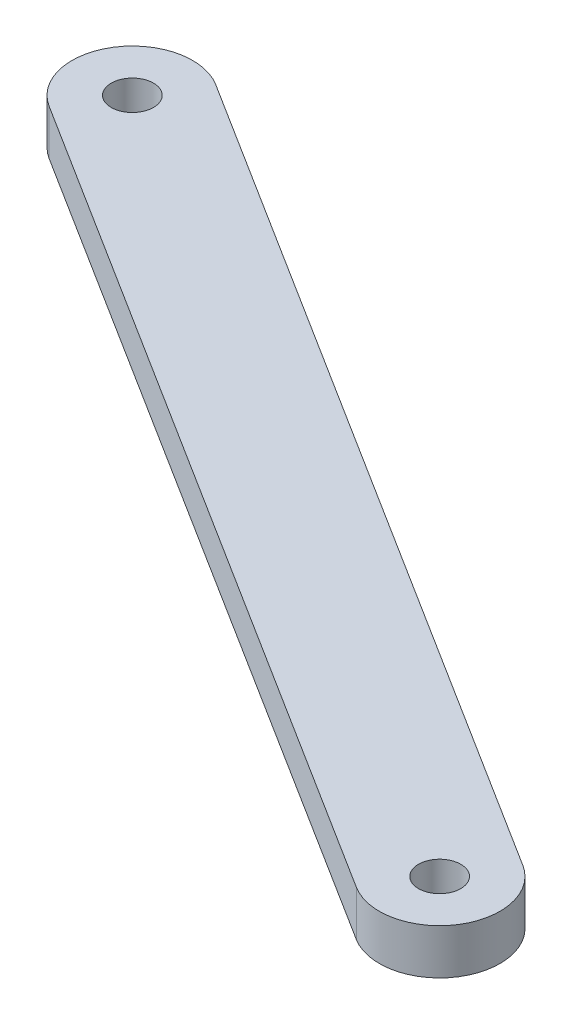
ISO-10303-21;
HEADER;
FILE_DESCRIPTION(('STEP AP214'),'2;1');
FILE_NAME('part.step','',(''),(''),'','','');
FILE_SCHEMA(('AUTOMOTIVE_DESIGN { 1 0 10303 214 1 1 1 1 }'));
ENDSEC;
DATA;
#1=APPLICATION_CONTEXT('core data for automotive mechanical design processes');
#2=APPLICATION_PROTOCOL_DEFINITION('international standard','automotive_design',2000,#1);
#3=PRODUCT_CONTEXT('',#1,'mechanical');
#4=PRODUCT('Part','Part','',(#3));
#5=PRODUCT_RELATED_PRODUCT_CATEGORY('part','',(#4));
#6=PRODUCT_DEFINITION_FORMATION('','',#4);
#7=PRODUCT_DEFINITION_CONTEXT('part definition',#1,'design');
#8=PRODUCT_DEFINITION('design','',#6,#7);
#9=PRODUCT_DEFINITION_SHAPE('','',#8);
#10=(LENGTH_UNIT() NAMED_UNIT(*) SI_UNIT(.MILLI.,.METRE.));
#11=(NAMED_UNIT(*) PLANE_ANGLE_UNIT() SI_UNIT($,.RADIAN.));
#12=(NAMED_UNIT(*) SI_UNIT($,.STERADIAN.) SOLID_ANGLE_UNIT());
#13=UNCERTAINTY_MEASURE_WITH_UNIT(LENGTH_MEASURE(1.E-05),#10,'distance_accuracy_value','');
#14=(GEOMETRIC_REPRESENTATION_CONTEXT(3) GLOBAL_UNCERTAINTY_ASSIGNED_CONTEXT((#13)) GLOBAL_UNIT_ASSIGNED_CONTEXT((#10,
#11,#12)) REPRESENTATION_CONTEXT('',''));
#15=CARTESIAN_POINT('',(0.,0.,0.));
#16=DIRECTION('',(0.,0.,1.));
#17=DIRECTION('',(1.,0.,0.));
#18=AXIS2_PLACEMENT_3D('',#15,#16,#17);
#19=CARTESIAN_POINT('',(-4.26393093977295,3.,22.8813440632616));
#20=DIRECTION('',(0.,1.,0.));
#21=DIRECTION('',(0.,0.,1.));
#22=AXIS2_PLACEMENT_3D('',#19,#20,#21);
#23=PLANE('',#22);
#24=CARTESIAN_POINT('',(-4.26393093977295,3.,22.8813440632616));
#25=DIRECTION('',(0.,1.,0.));
#26=DIRECTION('',(0.,0.,1.));
#27=AXIS2_PLACEMENT_3D('',#24,#25,#26);
#28=CIRCLE('',#27,1.4);
#29=CARTESIAN_POINT('',(-4.26393093977295,3.,24.2813440632616));
#30=VERTEX_POINT('',#29);
#31=EDGE_CURVE('E118',#30,#30,#28,.T.);
#32=ORIENTED_EDGE('',*,*,#31,.F.);
#33=EDGE_LOOP('',(#32));
#34=FACE_BOUND('',#33,.T.);
#35=CARTESIAN_POINT('',(-4.26393093977295,3.,22.8813440632616));
#36=DIRECTION('',(0.,1.,0.));
#37=DIRECTION('',(0.,0.,1.));
#38=AXIS2_PLACEMENT_3D('',#35,#36,#37);
#39=CIRCLE('',#38,4.);
#40=CARTESIAN_POINT('',(-6.39568577985772,3.,26.2659594478769));
#41=VERTEX_POINT('',#40);
#42=CARTESIAN_POINT('',(-2.13217609968818,3.,19.4967286786462));
#43=VERTEX_POINT('',#42);
#44=EDGE_CURVE('E98',#41,#43,#39,.T.);
#45=ORIENTED_EDGE('',*,*,#44,.T.);
#46=DIRECTION('',(-0.846153846153847,0.,-0.532938710021192));
#47=VECTOR('',#46,1.);
#48=CARTESIAN_POINT('',(-2.13217609968818,3.,19.4967286786462));
#49=LINE('',#48,#47);
#50=CARTESIAN_POINT('',(-57.1321760996882,3.,-15.1442874727313));
#51=VERTEX_POINT('',#50);
#52=EDGE_CURVE('E93',#43,#51,#49,.T.);
#53=ORIENTED_EDGE('',*,*,#52,.T.);
#54=CARTESIAN_POINT('',(-59.263930939773,3.,-11.7596720881159));
#55=DIRECTION('',(0.,1.,0.));
#56=DIRECTION('',(0.,0.,1.));
#57=AXIS2_PLACEMENT_3D('',#54,#55,#56);
#58=CIRCLE('',#57,4.);
#59=CARTESIAN_POINT('',(-61.3956857798578,3.,-8.37505670350053));
#60=VERTEX_POINT('',#59);
#61=EDGE_CURVE('E96',#51,#60,#58,.T.);
#62=ORIENTED_EDGE('',*,*,#61,.T.);
#63=DIRECTION('',(0.846153846153847,0.,0.532938710021192));
#64=VECTOR('',#63,1.);
#65=CARTESIAN_POINT('',(-61.3956857798578,3.,-8.37505670350053));
#66=LINE('',#65,#64);
#67=EDGE_CURVE('E63',#60,#41,#66,.T.);
#68=ORIENTED_EDGE('',*,*,#67,.T.);
#69=EDGE_LOOP('',(#45,#53,#62,#68));
#70=FACE_BOUND('',#69,.T.);
#71=CARTESIAN_POINT('',(-59.263930939773,3.,-11.7596720881159));
#72=DIRECTION('',(0.,1.,0.));
#73=DIRECTION('',(0.,0.,1.));
#74=AXIS2_PLACEMENT_3D('',#71,#72,#73);
#75=CIRCLE('',#74,1.4);
#76=CARTESIAN_POINT('',(-59.263930939773,3.,-10.3596720881159));
#77=VERTEX_POINT('',#76);
#78=EDGE_CURVE('E140',#77,#77,#75,.T.);
#79=ORIENTED_EDGE('',*,*,#78,.F.);
#80=EDGE_LOOP('',(#79));
#81=FACE_BOUND('',#80,.T.);
#82=ADVANCED_FACE('F45',(#34,#70,#81),#23,.T.);
#83=CARTESIAN_POINT('',(-4.26393093977295,0.,22.8813440632616));
#84=DIRECTION('',(0.,1.,0.));
#85=DIRECTION('',(0.,0.,1.));
#86=AXIS2_PLACEMENT_3D('',#83,#84,#85);
#87=PLANE('',#86);
#88=CARTESIAN_POINT('',(-4.26393093977295,0.,22.8813440632616));
#89=DIRECTION('',(0.,1.,0.));
#90=DIRECTION('',(0.,0.,1.));
#91=AXIS2_PLACEMENT_3D('',#88,#89,#90);
#92=CIRCLE('',#91,4.);
#93=CARTESIAN_POINT('',(-6.39568577985772,0.,26.2659594478769));
#94=VERTEX_POINT('',#93);
#95=CARTESIAN_POINT('',(-2.13217609968818,0.,19.4967286786462));
#96=VERTEX_POINT('',#95);
#97=EDGE_CURVE('E114',#94,#96,#92,.T.);
#98=ORIENTED_EDGE('',*,*,#97,.F.);
#99=DIRECTION('',(0.846153846153847,0.,0.532938710021192));
#100=VECTOR('',#99,1.);
#101=CARTESIAN_POINT('',(-61.3956857798578,0.,-8.37505670350053));
#102=LINE('',#101,#100);
#103=CARTESIAN_POINT('',(-61.3956857798578,0.,-8.37505670350053));
#104=VERTEX_POINT('',#103);
#105=EDGE_CURVE('E86',#104,#94,#102,.T.);
#106=ORIENTED_EDGE('',*,*,#105,.F.);
#107=CARTESIAN_POINT('',(-59.263930939773,0.,-11.7596720881159));
#108=DIRECTION('',(0.,1.,0.));
#109=DIRECTION('',(0.,0.,1.));
#110=AXIS2_PLACEMENT_3D('',#107,#108,#109);
#111=CIRCLE('',#110,4.);
#112=CARTESIAN_POINT('',(-57.1321760996882,0.,-15.1442874727313));
#113=VERTEX_POINT('',#112);
#114=EDGE_CURVE('E80',#113,#104,#111,.T.);
#115=ORIENTED_EDGE('',*,*,#114,.F.);
#116=DIRECTION('',(-0.846153846153847,0.,-0.532938710021192));
#117=VECTOR('',#116,1.);
#118=CARTESIAN_POINT('',(-2.13217609968818,0.,19.4967286786462));
#119=LINE('',#118,#117);
#120=EDGE_CURVE('E103',#96,#113,#119,.T.);
#121=ORIENTED_EDGE('',*,*,#120,.F.);
#122=EDGE_LOOP('',(#98,#106,#115,#121));
#123=FACE_BOUND('',#122,.T.);
#124=CARTESIAN_POINT('',(-4.26393093977295,0.,22.8813440632616));
#125=DIRECTION('',(0.,1.,0.));
#126=DIRECTION('',(0.,0.,1.));
#127=AXIS2_PLACEMENT_3D('',#124,#125,#126);
#128=CIRCLE('',#127,1.4);
#129=CARTESIAN_POINT('',(-4.26393093977295,0.,24.2813440632616));
#130=VERTEX_POINT('',#129);
#131=EDGE_CURVE('E136',#130,#130,#128,.T.);
#132=ORIENTED_EDGE('',*,*,#131,.T.);
#133=EDGE_LOOP('',(#132));
#134=FACE_BOUND('',#133,.T.);
#135=CARTESIAN_POINT('',(-59.263930939773,0.,-11.7596720881159));
#136=DIRECTION('',(0.,1.,0.));
#137=DIRECTION('',(0.,0.,1.));
#138=AXIS2_PLACEMENT_3D('',#135,#136,#137);
#139=CIRCLE('',#138,1.4);
#140=CARTESIAN_POINT('',(-59.263930939773,0.,-10.3596720881159));
#141=VERTEX_POINT('',#140);
#142=EDGE_CURVE('E144',#141,#141,#139,.T.);
#143=ORIENTED_EDGE('',*,*,#142,.T.);
#144=EDGE_LOOP('',(#143));
#145=FACE_BOUND('',#144,.T.);
#146=ADVANCED_FACE('F131',(#123,#134,#145),#87,.F.);
#147=CARTESIAN_POINT('',(-4.26393093977295,3.,22.8813440632616));
#148=DIRECTION('',(0.,-1.,0.));
#149=DIRECTION('',(0.,0.,-1.));
#150=AXIS2_PLACEMENT_3D('',#147,#148,#149);
#151=CYLINDRICAL_SURFACE('',#150,4.);
#152=ORIENTED_EDGE('',*,*,#97,.T.);
#153=DIRECTION('',(0.,-1.,0.));
#154=VECTOR('',#153,1.);
#155=CARTESIAN_POINT('',(-2.13217609968818,3.,19.4967286786462));
#156=LINE('',#155,#154);
#157=EDGE_CURVE('E11',#43,#96,#156,.T.);
#158=ORIENTED_EDGE('',*,*,#157,.F.);
#159=ORIENTED_EDGE('',*,*,#44,.F.);
#160=DIRECTION('',(0.,-1.,0.));
#161=VECTOR('',#160,1.);
#162=CARTESIAN_POINT('',(-6.39568577985772,3.,26.2659594478769));
#163=LINE('',#162,#161);
#164=EDGE_CURVE('E110',#41,#94,#163,.T.);
#165=ORIENTED_EDGE('',*,*,#164,.T.);
#166=EDGE_LOOP('',(#152,#158,#159,#165));
#167=FACE_BOUND('',#166,.T.);
#168=ADVANCED_FACE('F47',(#167),#151,.T.);
#169=CARTESIAN_POINT('',(-2.13217609968818,3.,19.4967286786462));
#170=DIRECTION('',(-0.532938710021192,0.,0.846153846153847));
#171=DIRECTION('',(0.846153846153847,0.,0.532938710021192));
#172=AXIS2_PLACEMENT_3D('',#169,#170,#171);
#173=PLANE('',#172);
#174=ORIENTED_EDGE('',*,*,#120,.T.);
#175=DIRECTION('',(0.,-1.,0.));
#176=VECTOR('',#175,1.);
#177=CARTESIAN_POINT('',(-57.1321760996882,3.,-15.1442874727313));
#178=LINE('',#177,#176);
#179=EDGE_CURVE('E55',#51,#113,#178,.T.);
#180=ORIENTED_EDGE('',*,*,#179,.F.);
#181=ORIENTED_EDGE('',*,*,#52,.F.);
#182=ORIENTED_EDGE('',*,*,#157,.T.);
#183=EDGE_LOOP('',(#174,#180,#181,#182));
#184=FACE_BOUND('',#183,.T.);
#185=ADVANCED_FACE('F102',(#184),#173,.F.);
#186=CARTESIAN_POINT('',(-59.263930939773,3.,-11.7596720881159));
#187=DIRECTION('',(0.,-1.,0.));
#188=DIRECTION('',(0.,0.,-1.));
#189=AXIS2_PLACEMENT_3D('',#186,#187,#188);
#190=CYLINDRICAL_SURFACE('',#189,4.);
#191=ORIENTED_EDGE('',*,*,#114,.T.);
#192=DIRECTION('',(0.,-1.,0.));
#193=VECTOR('',#192,1.);
#194=CARTESIAN_POINT('',(-61.3956857798578,3.,-8.37505670350053));
#195=LINE('',#194,#193);
#196=EDGE_CURVE('E105',#60,#104,#195,.T.);
#197=ORIENTED_EDGE('',*,*,#196,.F.);
#198=ORIENTED_EDGE('',*,*,#61,.F.);
#199=ORIENTED_EDGE('',*,*,#179,.T.);
#200=EDGE_LOOP('',(#191,#197,#198,#199));
#201=FACE_BOUND('',#200,.T.);
#202=ADVANCED_FACE('F106',(#201),#190,.T.);
#203=CARTESIAN_POINT('',(-61.3956857798578,3.,-8.37505670350053));
#204=DIRECTION('',(0.532938710021192,0.,-0.846153846153847));
#205=DIRECTION('',(-0.846153846153847,0.,-0.532938710021192));
#206=AXIS2_PLACEMENT_3D('',#203,#204,#205);
#207=PLANE('',#206);
#208=ORIENTED_EDGE('',*,*,#105,.T.);
#209=ORIENTED_EDGE('',*,*,#164,.F.);
#210=ORIENTED_EDGE('',*,*,#67,.F.);
#211=ORIENTED_EDGE('',*,*,#196,.T.);
#212=EDGE_LOOP('',(#208,#209,#210,#211));
#213=FACE_BOUND('',#212,.T.);
#214=ADVANCED_FACE('F128',(#213),#207,.F.);
#215=CARTESIAN_POINT('',(-4.26393093977295,3.,22.8813440632616));
#216=DIRECTION('',(0.,-1.,0.));
#217=DIRECTION('',(0.,0.,-1.));
#218=AXIS2_PLACEMENT_3D('',#215,#216,#217);
#219=CYLINDRICAL_SURFACE('',#218,1.4);
#220=ORIENTED_EDGE('',*,*,#31,.T.);
#221=EDGE_LOOP('',(#220));
#222=FACE_BOUND('',#221,.T.);
#223=ORIENTED_EDGE('',*,*,#131,.F.);
#224=EDGE_LOOP('',(#223));
#225=FACE_BOUND('',#224,.T.);
#226=ADVANCED_FACE('F163',(#222,#225),#219,.F.);
#227=CARTESIAN_POINT('',(-59.263930939773,3.,-11.7596720881159));
#228=DIRECTION('',(0.,-1.,0.));
#229=DIRECTION('',(0.,0.,-1.));
#230=AXIS2_PLACEMENT_3D('',#227,#228,#229);
#231=CYLINDRICAL_SURFACE('',#230,1.4);
#232=ORIENTED_EDGE('',*,*,#78,.T.);
#233=EDGE_LOOP('',(#232));
#234=FACE_BOUND('',#233,.T.);
#235=ORIENTED_EDGE('',*,*,#142,.F.);
#236=EDGE_LOOP('',(#235));
#237=FACE_BOUND('',#236,.T.);
#238=ADVANCED_FACE('F152',(#234,#237),#231,.F.);
#239=CLOSED_SHELL('',(#82,#146,#168,#185,#202,#214,#226,#238));
#240=MANIFOLD_SOLID_BREP('B2',#239);
#241=ADVANCED_BREP_SHAPE_REPRESENTATION('',(#18,#240),#14);
#242=SHAPE_DEFINITION_REPRESENTATION(#9,#241);
ENDSEC;
END-ISO-10303-21;
